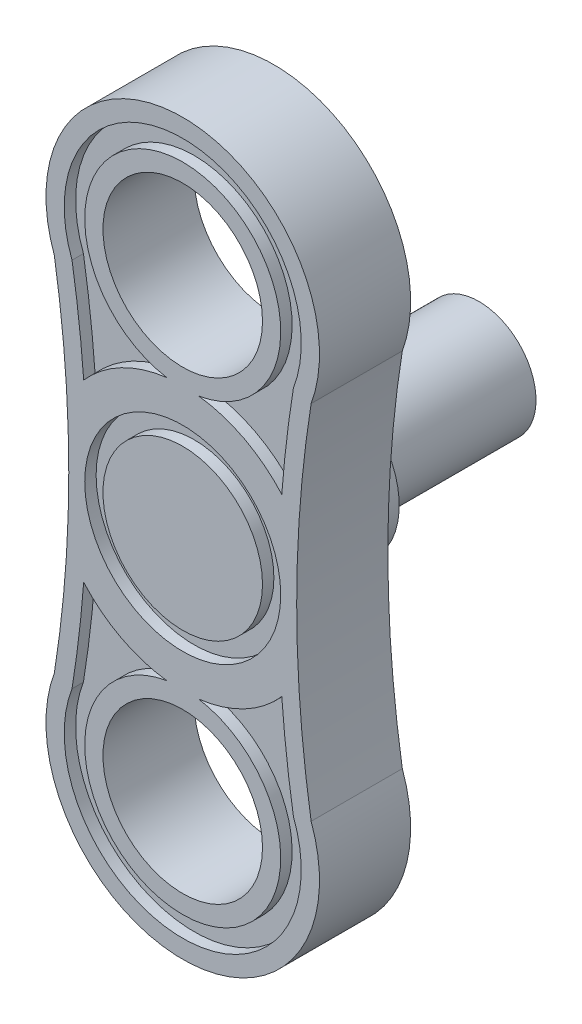
ISO-10303-21;
HEADER;
FILE_DESCRIPTION(('STEP AP214'),'2;1');
FILE_NAME('part.step','',(''),(''),'','','');
FILE_SCHEMA(('AUTOMOTIVE_DESIGN { 1 0 10303 214 1 1 1 1 }'));
ENDSEC;
DATA;
#1=APPLICATION_CONTEXT('core data for automotive mechanical design processes');
#2=APPLICATION_PROTOCOL_DEFINITION('international standard','automotive_design',2000,#1);
#3=PRODUCT_CONTEXT('',#1,'mechanical');
#4=PRODUCT('Part','Part','',(#3));
#5=PRODUCT_RELATED_PRODUCT_CATEGORY('part','',(#4));
#6=PRODUCT_DEFINITION_FORMATION('','',#4);
#7=PRODUCT_DEFINITION_CONTEXT('part definition',#1,'design');
#8=PRODUCT_DEFINITION('design','',#6,#7);
#9=PRODUCT_DEFINITION_SHAPE('','',#8);
#10=(LENGTH_UNIT() NAMED_UNIT(*) SI_UNIT(.MILLI.,.METRE.));
#11=(NAMED_UNIT(*) PLANE_ANGLE_UNIT() SI_UNIT($,.RADIAN.));
#12=(NAMED_UNIT(*) SI_UNIT($,.STERADIAN.) SOLID_ANGLE_UNIT());
#13=UNCERTAINTY_MEASURE_WITH_UNIT(LENGTH_MEASURE(1.E-05),#10,'distance_accuracy_value','');
#14=(GEOMETRIC_REPRESENTATION_CONTEXT(3) GLOBAL_UNCERTAINTY_ASSIGNED_CONTEXT((#13)) GLOBAL_UNIT_ASSIGNED_CONTEXT((#10,
#11,#12)) REPRESENTATION_CONTEXT('',''));
#15=CARTESIAN_POINT('',(0.,0.,0.));
#16=DIRECTION('',(0.,0.,1.));
#17=DIRECTION('',(1.,0.,0.));
#18=AXIS2_PLACEMENT_3D('',#15,#16,#17);
#19=CARTESIAN_POINT('',(-275.,-50.,0.));
#20=DIRECTION('',(0.,0.,1.));
#21=DIRECTION('',(1.,0.,0.));
#22=AXIS2_PLACEMENT_3D('',#19,#20,#21);
#23=PLANE('',#22);
#24=CARTESIAN_POINT('',(0.,-200.,0.));
#25=DIRECTION('',(0.,0.,1.));
#26=DIRECTION('',(1.,0.,0.));
#27=AXIS2_PLACEMENT_3D('',#24,#25,#26);
#28=CIRCLE('',#27,35.);
#29=CARTESIAN_POINT('',(35.,-200.,0.));
#30=VERTEX_POINT('',#29);
#31=EDGE_CURVE('E602',#30,#30,#28,.F.);
#32=ORIENTED_EDGE('',*,*,#31,.T.);
#33=EDGE_LOOP('',(#32));
#34=FACE_BOUND('',#33,.T.);
#35=CARTESIAN_POINT('',(-550.,-100.,0.));
#36=DIRECTION('',(0.,0.,-1.));
#37=DIRECTION('',(1.,0.,0.));
#38=AXIS2_PLACEMENT_3D('',#35,#36,#37);
#39=CIRCLE('',#38,500.);
#40=CARTESIAN_POINT('',(-56.3381847087752,-20.6399841017363,0.));
#41=VERTEX_POINT('',#40);
#42=CARTESIAN_POINT('',(-56.3381847087752,-179.360015898264,0.));
#43=VERTEX_POINT('',#42);
#44=EDGE_CURVE('E304',#41,#43,#39,.T.);
#45=ORIENTED_EDGE('',*,*,#44,.T.);
#46=CARTESIAN_POINT('',(0.,-200.,0.));
#47=DIRECTION('',(0.,0.,1.));
#48=DIRECTION('',(1.,0.,0.));
#49=AXIS2_PLACEMENT_3D('',#46,#47,#48);
#50=CIRCLE('',#49,60.);
#51=CARTESIAN_POINT('',(56.3381847087753,-179.360015898264,0.));
#52=VERTEX_POINT('',#51);
#53=EDGE_CURVE('E321',#43,#52,#50,.T.);
#54=ORIENTED_EDGE('',*,*,#53,.T.);
#55=CARTESIAN_POINT('',(550.,-100.,0.));
#56=DIRECTION('',(0.,0.,-1.));
#57=DIRECTION('',(-1.,0.,0.));
#58=AXIS2_PLACEMENT_3D('',#55,#56,#57);
#59=CIRCLE('',#58,500.);
#60=CARTESIAN_POINT('',(56.3381847087752,-20.6399841017363,0.));
#61=VERTEX_POINT('',#60);
#62=EDGE_CURVE('E324',#52,#61,#59,.T.);
#63=ORIENTED_EDGE('',*,*,#62,.T.);
#64=CARTESIAN_POINT('',(0.,0.,0.));
#65=DIRECTION('',(0.,0.,1.));
#66=DIRECTION('',(1.,0.,0.));
#67=AXIS2_PLACEMENT_3D('',#64,#65,#66);
#68=CIRCLE('',#67,60.);
#69=EDGE_CURVE('E309',#61,#41,#68,.T.);
#70=ORIENTED_EDGE('',*,*,#69,.T.);
#71=EDGE_LOOP('',(#45,#54,#63,#70));
#72=FACE_BOUND('',#71,.T.);
#73=CARTESIAN_POINT('',(0.,-200.,0.));
#74=DIRECTION('',(0.,0.,-1.));
#75=DIRECTION('',(-1.,0.,0.));
#76=AXIS2_PLACEMENT_3D('',#73,#74,#75);
#77=CIRCLE('',#76,43.);
#78=CARTESIAN_POINT('',(7.00852159873964,-157.575,0.));
#79=VERTEX_POINT('',#78);
#80=CARTESIAN_POINT('',(-7.00852159873959,-157.575,0.));
#81=VERTEX_POINT('',#80);
#82=EDGE_CURVE('E265',#79,#81,#77,.T.);
#83=ORIENTED_EDGE('',*,*,#82,.F.);
#84=CARTESIAN_POINT('',(0.,-100.,0.));
#85=DIRECTION('',(0.,0.,1.));
#86=DIRECTION('',(1.,0.,0.));
#87=AXIS2_PLACEMENT_3D('',#84,#85,#86);
#88=CIRCLE('',#87,57.9999999999996);
#89=CARTESIAN_POINT('',(43.4545454545454,-138.414873152709,0.));
#90=VERTEX_POINT('',#89);
#91=EDGE_CURVE('E111',#79,#90,#88,.T.);
#92=ORIENTED_EDGE('',*,*,#91,.T.);
#93=CARTESIAN_POINT('',(550.,-100.,0.));
#94=DIRECTION('',(0.,0.,1.));
#95=DIRECTION('',(1.,0.,0.));
#96=AXIS2_PLACEMENT_3D('',#93,#94,#95);
#97=CIRCLE('',#96,508.);
#98=CARTESIAN_POINT('',(48.5672389748015,-181.419814361408,0.));
#99=VERTEX_POINT('',#98);
#100=EDGE_CURVE('E279',#90,#99,#97,.T.);
#101=ORIENTED_EDGE('',*,*,#100,.T.);
#102=CARTESIAN_POINT('',(0.,-200.,0.));
#103=DIRECTION('',(0.,0.,1.));
#104=DIRECTION('',(1.,0.,0.));
#105=AXIS2_PLACEMENT_3D('',#102,#103,#104);
#106=CIRCLE('',#105,52.);
#107=CARTESIAN_POINT('',(-48.5672389748017,-181.419814361409,0.));
#108=VERTEX_POINT('',#107);
#109=EDGE_CURVE('E282',#108,#99,#106,.T.);
#110=ORIENTED_EDGE('',*,*,#109,.F.);
#111=CARTESIAN_POINT('',(-550.,-100.,0.));
#112=DIRECTION('',(0.,0.,1.));
#113=DIRECTION('',(1.,0.,0.));
#114=AXIS2_PLACEMENT_3D('',#111,#112,#113);
#115=CIRCLE('',#114,508.);
#116=CARTESIAN_POINT('',(-43.4545454545454,-138.41487315271,0.));
#117=VERTEX_POINT('',#116);
#118=EDGE_CURVE('E285',#108,#117,#115,.T.);
#119=ORIENTED_EDGE('',*,*,#118,.T.);
#120=CARTESIAN_POINT('',(0.,-100.,0.));
#121=DIRECTION('',(0.,0.,1.));
#122=DIRECTION('',(1.,0.,0.));
#123=AXIS2_PLACEMENT_3D('',#120,#121,#122);
#124=CIRCLE('',#123,57.9999999999996);
#125=EDGE_CURVE('E288',#117,#81,#124,.T.);
#126=ORIENTED_EDGE('',*,*,#125,.T.);
#127=EDGE_LOOP('',(#83,#92,#101,#110,#119,#126));
#128=FACE_BOUND('',#127,.T.);
#129=CARTESIAN_POINT('',(0.,-100.,0.));
#130=DIRECTION('',(0.,0.,1.));
#131=DIRECTION('',(1.,0.,0.));
#132=AXIS2_PLACEMENT_3D('',#129,#130,#131);
#133=CIRCLE('',#132,57.9999999999992);
#134=CARTESIAN_POINT('',(43.4545454545454,-61.5851268472906,0.));
#135=VERTEX_POINT('',#134);
#136=CARTESIAN_POINT('',(7.00852159873692,-42.4250000000004,0.));
#137=VERTEX_POINT('',#136);
#138=EDGE_CURVE('E218',#135,#137,#133,.T.);
#139=ORIENTED_EDGE('',*,*,#138,.T.);
#140=CARTESIAN_POINT('',(0.,0.,0.));
#141=DIRECTION('',(0.,0.,1.));
#142=DIRECTION('',(1.,0.,0.));
#143=AXIS2_PLACEMENT_3D('',#140,#141,#142);
#144=CIRCLE('',#143,43.);
#145=CARTESIAN_POINT('',(-7.00852159873692,-42.4250000000004,0.));
#146=VERTEX_POINT('',#145);
#147=EDGE_CURVE('E103',#137,#146,#144,.T.);
#148=ORIENTED_EDGE('',*,*,#147,.T.);
#149=CARTESIAN_POINT('',(0.,-100.,0.));
#150=DIRECTION('',(0.,0.,1.));
#151=DIRECTION('',(1.,0.,0.));
#152=AXIS2_PLACEMENT_3D('',#149,#150,#151);
#153=CIRCLE('',#152,57.9999999999992);
#154=CARTESIAN_POINT('',(-43.4545454545454,-61.5851268472905,0.));
#155=VERTEX_POINT('',#154);
#156=EDGE_CURVE('E233',#146,#155,#153,.T.);
#157=ORIENTED_EDGE('',*,*,#156,.T.);
#158=CARTESIAN_POINT('',(-550.,-100.,0.));
#159=DIRECTION('',(0.,0.,1.));
#160=DIRECTION('',(1.,0.,0.));
#161=AXIS2_PLACEMENT_3D('',#158,#159,#160);
#162=CIRCLE('',#161,508.);
#163=CARTESIAN_POINT('',(-48.5672389748015,-18.5801856385915,0.));
#164=VERTEX_POINT('',#163);
#165=EDGE_CURVE('E228',#155,#164,#162,.T.);
#166=ORIENTED_EDGE('',*,*,#165,.T.);
#167=CARTESIAN_POINT('',(0.,0.,0.));
#168=DIRECTION('',(0.,0.,1.));
#169=DIRECTION('',(1.,0.,0.));
#170=AXIS2_PLACEMENT_3D('',#167,#168,#169);
#171=CIRCLE('',#170,52.);
#172=CARTESIAN_POINT('',(48.5672389748018,-18.5801856385908,0.));
#173=VERTEX_POINT('',#172);
#174=EDGE_CURVE('E226',#173,#164,#171,.T.);
#175=ORIENTED_EDGE('',*,*,#174,.F.);
#176=CARTESIAN_POINT('',(550.,-100.,0.));
#177=DIRECTION('',(0.,0.,1.));
#178=DIRECTION('',(1.,0.,0.));
#179=AXIS2_PLACEMENT_3D('',#176,#177,#178);
#180=CIRCLE('',#179,508.);
#181=EDGE_CURVE('E208',#173,#135,#180,.T.);
#182=ORIENTED_EDGE('',*,*,#181,.T.);
#183=EDGE_LOOP('',(#139,#148,#157,#166,#175,#182));
#184=FACE_BOUND('',#183,.T.);
#185=CARTESIAN_POINT('',(0.,-100.,0.));
#186=DIRECTION('',(0.,0.,1.));
#187=DIRECTION('',(1.,0.,0.));
#188=AXIS2_PLACEMENT_3D('',#185,#186,#187);
#189=CIRCLE('',#188,43.);
#190=CARTESIAN_POINT('',(43.,-100.,0.));
#191=VERTEX_POINT('',#190);
#192=EDGE_CURVE('E250',#191,#191,#189,.T.);
#193=ORIENTED_EDGE('',*,*,#192,.F.);
#194=EDGE_LOOP('',(#193));
#195=FACE_BOUND('',#194,.T.);
#196=CARTESIAN_POINT('',(0.,0.,0.));
#197=DIRECTION('',(0.,0.,1.));
#198=DIRECTION('',(1.,0.,0.));
#199=AXIS2_PLACEMENT_3D('',#196,#197,#198);
#200=CIRCLE('',#199,35.);
#201=CARTESIAN_POINT('',(35.,0.,0.));
#202=VERTEX_POINT('',#201);
#203=EDGE_CURVE('E606',#202,#202,#200,.T.);
#204=ORIENTED_EDGE('',*,*,#203,.F.);
#205=EDGE_LOOP('',(#204));
#206=FACE_BOUND('',#205,.T.);
#207=ADVANCED_FACE('F86',(#34,#72,#128,#184,#195,#206),#23,.T.);
#208=CARTESIAN_POINT('',(-275.,-50.,-40.));
#209=DIRECTION('',(0.,0.,1.));
#210=DIRECTION('',(1.,0.,0.));
#211=AXIS2_PLACEMENT_3D('',#208,#209,#210);
#212=PLANE('',#211);
#213=CARTESIAN_POINT('',(0.,-100.,-40.));
#214=DIRECTION('',(0.,0.,-1.));
#215=DIRECTION('',(-1.,0.,0.));
#216=AXIS2_PLACEMENT_3D('',#213,#214,#215);
#217=CIRCLE('',#216,35.);
#218=CARTESIAN_POINT('',(-35.,-100.,-40.));
#219=VERTEX_POINT('',#218);
#220=EDGE_CURVE('E12',#219,#219,#217,.T.);
#221=ORIENTED_EDGE('',*,*,#220,.F.);
#222=EDGE_LOOP('',(#221));
#223=FACE_BOUND('',#222,.T.);
#224=CARTESIAN_POINT('',(-550.,-100.,-40.));
#225=DIRECTION('',(0.,0.,-1.));
#226=DIRECTION('',(1.,0.,0.));
#227=AXIS2_PLACEMENT_3D('',#224,#225,#226);
#228=CIRCLE('',#227,500.);
#229=CARTESIAN_POINT('',(-56.3381847087752,-20.6399841017363,-40.));
#230=VERTEX_POINT('',#229);
#231=CARTESIAN_POINT('',(-56.3381847087752,-179.360015898264,-40.));
#232=VERTEX_POINT('',#231);
#233=EDGE_CURVE('E305',#230,#232,#228,.T.);
#234=ORIENTED_EDGE('',*,*,#233,.F.);
#235=CARTESIAN_POINT('',(0.,0.,-40.));
#236=DIRECTION('',(0.,0.,1.));
#237=DIRECTION('',(1.,0.,0.));
#238=AXIS2_PLACEMENT_3D('',#235,#236,#237);
#239=CIRCLE('',#238,60.);
#240=CARTESIAN_POINT('',(56.3381847087752,-20.6399841017363,-40.));
#241=VERTEX_POINT('',#240);
#242=EDGE_CURVE('E315',#241,#230,#239,.T.);
#243=ORIENTED_EDGE('',*,*,#242,.F.);
#244=CARTESIAN_POINT('',(550.,-100.,-40.));
#245=DIRECTION('',(0.,0.,-1.));
#246=DIRECTION('',(-1.,0.,0.));
#247=AXIS2_PLACEMENT_3D('',#244,#245,#246);
#248=CIRCLE('',#247,500.);
#249=CARTESIAN_POINT('',(56.3381847087753,-179.360015898264,-40.));
#250=VERTEX_POINT('',#249);
#251=EDGE_CURVE('E312',#250,#241,#248,.T.);
#252=ORIENTED_EDGE('',*,*,#251,.F.);
#253=CARTESIAN_POINT('',(0.,-200.,-40.));
#254=DIRECTION('',(0.,0.,1.));
#255=DIRECTION('',(1.,0.,0.));
#256=AXIS2_PLACEMENT_3D('',#253,#254,#255);
#257=CIRCLE('',#256,60.);
#258=EDGE_CURVE('E308',#232,#250,#257,.T.);
#259=ORIENTED_EDGE('',*,*,#258,.F.);
#260=EDGE_LOOP('',(#234,#243,#252,#259));
#261=FACE_BOUND('',#260,.T.);
#262=CARTESIAN_POINT('',(0.,-200.,-40.));
#263=DIRECTION('',(0.,0.,-1.));
#264=DIRECTION('',(-1.,0.,0.));
#265=AXIS2_PLACEMENT_3D('',#262,#263,#264);
#266=CIRCLE('',#265,35.);
#267=CARTESIAN_POINT('',(-35.,-200.,-40.));
#268=VERTEX_POINT('',#267);
#269=EDGE_CURVE('E597',#268,#268,#266,.T.);
#270=ORIENTED_EDGE('',*,*,#269,.F.);
#271=EDGE_LOOP('',(#270));
#272=FACE_BOUND('',#271,.T.);
#273=CARTESIAN_POINT('',(0.,0.,-40.));
#274=DIRECTION('',(0.,0.,1.));
#275=DIRECTION('',(1.,0.,0.));
#276=AXIS2_PLACEMENT_3D('',#273,#274,#275);
#277=CIRCLE('',#276,35.);
#278=CARTESIAN_POINT('',(35.,0.,-40.));
#279=VERTEX_POINT('',#278);
#280=EDGE_CURVE('E599',#279,#279,#277,.T.);
#281=ORIENTED_EDGE('',*,*,#280,.T.);
#282=EDGE_LOOP('',(#281));
#283=FACE_BOUND('',#282,.T.);
#284=ADVANCED_FACE('F348',(#223,#261,#272,#283),#212,.F.);
#285=CARTESIAN_POINT('',(-550.,-100.,-40.));
#286=DIRECTION('',(0.,0.,1.));
#287=DIRECTION('',(1.,0.,0.));
#288=AXIS2_PLACEMENT_3D('',#285,#286,#287);
#289=CYLINDRICAL_SURFACE('',#288,500.);
#290=ORIENTED_EDGE('',*,*,#44,.F.);
#291=DIRECTION('',(0.,0.,1.));
#292=VECTOR('',#291,1.);
#293=CARTESIAN_POINT('',(-56.3381847087752,-20.6399841017363,-40.));
#294=LINE('',#293,#292);
#295=EDGE_CURVE('E95',#230,#41,#294,.T.);
#296=ORIENTED_EDGE('',*,*,#295,.F.);
#297=ORIENTED_EDGE('',*,*,#233,.T.);
#298=DIRECTION('',(0.,0.,1.));
#299=VECTOR('',#298,1.);
#300=CARTESIAN_POINT('',(-56.3381847087752,-179.360015898264,-40.));
#301=LINE('',#300,#299);
#302=EDGE_CURVE('E318',#232,#43,#301,.T.);
#303=ORIENTED_EDGE('',*,*,#302,.T.);
#304=EDGE_LOOP('',(#290,#296,#297,#303));
#305=FACE_BOUND('',#304,.T.);
#306=ADVANCED_FACE('F88',(#305),#289,.F.);
#307=CARTESIAN_POINT('',(0.,0.,-40.));
#308=DIRECTION('',(0.,0.,1.));
#309=DIRECTION('',(1.,0.,0.));
#310=AXIS2_PLACEMENT_3D('',#307,#308,#309);
#311=CYLINDRICAL_SURFACE('',#310,60.);
#312=ORIENTED_EDGE('',*,*,#69,.F.);
#313=DIRECTION('',(0.,0.,1.));
#314=VECTOR('',#313,1.);
#315=CARTESIAN_POINT('',(56.3381847087752,-20.6399841017363,-40.));
#316=LINE('',#315,#314);
#317=EDGE_CURVE('E330',#241,#61,#316,.T.);
#318=ORIENTED_EDGE('',*,*,#317,.F.);
#319=ORIENTED_EDGE('',*,*,#242,.T.);
#320=ORIENTED_EDGE('',*,*,#295,.T.);
#321=EDGE_LOOP('',(#312,#318,#319,#320));
#322=FACE_BOUND('',#321,.T.);
#323=ADVANCED_FACE('F345',(#322),#311,.T.);
#324=CARTESIAN_POINT('',(550.,-100.,-40.));
#325=DIRECTION('',(0.,0.,1.));
#326=DIRECTION('',(1.,0.,0.));
#327=AXIS2_PLACEMENT_3D('',#324,#325,#326);
#328=CYLINDRICAL_SURFACE('',#327,500.);
#329=ORIENTED_EDGE('',*,*,#62,.F.);
#330=DIRECTION('',(0.,0.,1.));
#331=VECTOR('',#330,1.);
#332=CARTESIAN_POINT('',(56.3381847087753,-179.360015898264,-40.));
#333=LINE('',#332,#331);
#334=EDGE_CURVE('E332',#250,#52,#333,.T.);
#335=ORIENTED_EDGE('',*,*,#334,.F.);
#336=ORIENTED_EDGE('',*,*,#251,.T.);
#337=ORIENTED_EDGE('',*,*,#317,.T.);
#338=EDGE_LOOP('',(#329,#335,#336,#337));
#339=FACE_BOUND('',#338,.T.);
#340=ADVANCED_FACE('F352',(#339),#328,.F.);
#341=CARTESIAN_POINT('',(0.,-200.,-40.));
#342=DIRECTION('',(0.,0.,1.));
#343=DIRECTION('',(1.,0.,0.));
#344=AXIS2_PLACEMENT_3D('',#341,#342,#343);
#345=CYLINDRICAL_SURFACE('',#344,60.);
#346=ORIENTED_EDGE('',*,*,#53,.F.);
#347=ORIENTED_EDGE('',*,*,#302,.F.);
#348=ORIENTED_EDGE('',*,*,#258,.T.);
#349=ORIENTED_EDGE('',*,*,#334,.T.);
#350=EDGE_LOOP('',(#346,#347,#348,#349));
#351=FACE_BOUND('',#350,.T.);
#352=ADVANCED_FACE('F339',(#351),#345,.T.);
#353=CARTESIAN_POINT('',(0.,-100.,-5.));
#354=DIRECTION('',(0.,0.,1.));
#355=DIRECTION('',(1.,0.,0.));
#356=AXIS2_PLACEMENT_3D('',#353,#354,#355);
#357=CYLINDRICAL_SURFACE('',#356,57.9999999999996);
#358=ORIENTED_EDGE('',*,*,#91,.F.);
#359=DIRECTION('',(0.,0.,1.));
#360=VECTOR('',#359,1.);
#361=CARTESIAN_POINT('',(7.00852159873964,-157.575,-5.));
#362=LINE('',#361,#360);
#363=CARTESIAN_POINT('',(7.00852159873964,-157.575,-5.));
#364=VERTEX_POINT('',#363);
#365=EDGE_CURVE('E277',#364,#79,#362,.T.);
#366=ORIENTED_EDGE('',*,*,#365,.F.);
#367=CARTESIAN_POINT('',(0.,-100.,-5.));
#368=DIRECTION('',(0.,0.,1.));
#369=DIRECTION('',(1.,0.,0.));
#370=AXIS2_PLACEMENT_3D('',#367,#368,#369);
#371=CIRCLE('',#370,57.9999999999996);
#372=CARTESIAN_POINT('',(43.4545454545454,-138.414873152709,-5.));
#373=VERTEX_POINT('',#372);
#374=EDGE_CURVE('E261',#364,#373,#371,.T.);
#375=ORIENTED_EDGE('',*,*,#374,.T.);
#376=DIRECTION('',(0.,0.,1.));
#377=VECTOR('',#376,1.);
#378=CARTESIAN_POINT('',(43.4545454545454,-138.414873152709,-5.));
#379=LINE('',#378,#377);
#380=EDGE_CURVE('E302',#373,#90,#379,.T.);
#381=ORIENTED_EDGE('',*,*,#380,.T.);
#382=EDGE_LOOP('',(#358,#366,#375,#381));
#383=FACE_BOUND('',#382,.T.);
#384=ADVANCED_FACE('F359',(#383),#357,.T.);
#385=CARTESIAN_POINT('',(550.,-100.,-5.));
#386=DIRECTION('',(0.,0.,1.));
#387=DIRECTION('',(1.,0.,0.));
#388=AXIS2_PLACEMENT_3D('',#385,#386,#387);
#389=CYLINDRICAL_SURFACE('',#388,508.);
#390=ORIENTED_EDGE('',*,*,#100,.F.);
#391=ORIENTED_EDGE('',*,*,#380,.F.);
#392=CARTESIAN_POINT('',(550.,-100.,-5.));
#393=DIRECTION('',(0.,0.,1.));
#394=DIRECTION('',(1.,0.,0.));
#395=AXIS2_PLACEMENT_3D('',#392,#393,#394);
#396=CIRCLE('',#395,508.);
#397=CARTESIAN_POINT('',(48.5672389748015,-181.419814361408,-5.));
#398=VERTEX_POINT('',#397);
#399=EDGE_CURVE('E264',#373,#398,#396,.T.);
#400=ORIENTED_EDGE('',*,*,#399,.T.);
#401=DIRECTION('',(0.,0.,1.));
#402=VECTOR('',#401,1.);
#403=CARTESIAN_POINT('',(48.5672389748015,-181.419814361408,-5.));
#404=LINE('',#403,#402);
#405=EDGE_CURVE('E300',#398,#99,#404,.T.);
#406=ORIENTED_EDGE('',*,*,#405,.T.);
#407=EDGE_LOOP('',(#390,#391,#400,#406));
#408=FACE_BOUND('',#407,.T.);
#409=ADVANCED_FACE('F415',(#408),#389,.T.);
#410=CARTESIAN_POINT('',(0.,-200.,-5.));
#411=DIRECTION('',(0.,0.,1.));
#412=DIRECTION('',(1.,0.,0.));
#413=AXIS2_PLACEMENT_3D('',#410,#411,#412);
#414=CYLINDRICAL_SURFACE('',#413,52.);
#415=ORIENTED_EDGE('',*,*,#109,.T.);
#416=ORIENTED_EDGE('',*,*,#405,.F.);
#417=CARTESIAN_POINT('',(0.,-200.,-5.));
#418=DIRECTION('',(0.,0.,1.));
#419=DIRECTION('',(1.,0.,0.));
#420=AXIS2_PLACEMENT_3D('',#417,#418,#419);
#421=CIRCLE('',#420,52.);
#422=CARTESIAN_POINT('',(-48.5672389748017,-181.419814361409,-5.));
#423=VERTEX_POINT('',#422);
#424=EDGE_CURVE('E267',#423,#398,#421,.T.);
#425=ORIENTED_EDGE('',*,*,#424,.F.);
#426=DIRECTION('',(0.,0.,1.));
#427=VECTOR('',#426,1.);
#428=CARTESIAN_POINT('',(-48.5672389748017,-181.419814361409,-5.));
#429=LINE('',#428,#427);
#430=EDGE_CURVE('E298',#423,#108,#429,.T.);
#431=ORIENTED_EDGE('',*,*,#430,.T.);
#432=EDGE_LOOP('',(#415,#416,#425,#431));
#433=FACE_BOUND('',#432,.T.);
#434=ADVANCED_FACE('F411',(#433),#414,.F.);
#435=CARTESIAN_POINT('',(-550.,-100.,-5.));
#436=DIRECTION('',(0.,0.,1.));
#437=DIRECTION('',(1.,0.,0.));
#438=AXIS2_PLACEMENT_3D('',#435,#436,#437);
#439=CYLINDRICAL_SURFACE('',#438,508.);
#440=ORIENTED_EDGE('',*,*,#118,.F.);
#441=ORIENTED_EDGE('',*,*,#430,.F.);
#442=CARTESIAN_POINT('',(-550.,-100.,-5.));
#443=DIRECTION('',(0.,0.,1.));
#444=DIRECTION('',(1.,0.,0.));
#445=AXIS2_PLACEMENT_3D('',#442,#443,#444);
#446=CIRCLE('',#445,508.);
#447=CARTESIAN_POINT('',(-43.4545454545454,-138.41487315271,-5.));
#448=VERTEX_POINT('',#447);
#449=EDGE_CURVE('E270',#423,#448,#446,.T.);
#450=ORIENTED_EDGE('',*,*,#449,.T.);
#451=DIRECTION('',(0.,0.,1.));
#452=VECTOR('',#451,1.);
#453=CARTESIAN_POINT('',(-43.4545454545454,-138.41487315271,-5.));
#454=LINE('',#453,#452);
#455=EDGE_CURVE('E296',#448,#117,#454,.T.);
#456=ORIENTED_EDGE('',*,*,#455,.T.);
#457=EDGE_LOOP('',(#440,#441,#450,#456));
#458=FACE_BOUND('',#457,.T.);
#459=ADVANCED_FACE('F407',(#458),#439,.T.);
#460=CARTESIAN_POINT('',(0.,-100.,-5.));
#461=DIRECTION('',(0.,0.,1.));
#462=DIRECTION('',(1.,0.,0.));
#463=AXIS2_PLACEMENT_3D('',#460,#461,#462);
#464=CYLINDRICAL_SURFACE('',#463,57.9999999999996);
#465=ORIENTED_EDGE('',*,*,#125,.F.);
#466=ORIENTED_EDGE('',*,*,#455,.F.);
#467=CARTESIAN_POINT('',(0.,-100.,-5.));
#468=DIRECTION('',(0.,0.,1.));
#469=DIRECTION('',(1.,0.,0.));
#470=AXIS2_PLACEMENT_3D('',#467,#468,#469);
#471=CIRCLE('',#470,57.9999999999996);
#472=CARTESIAN_POINT('',(-7.00852159873959,-157.575,-5.));
#473=VERTEX_POINT('',#472);
#474=EDGE_CURVE('E272',#448,#473,#471,.T.);
#475=ORIENTED_EDGE('',*,*,#474,.T.);
#476=DIRECTION('',(0.,0.,1.));
#477=VECTOR('',#476,1.);
#478=CARTESIAN_POINT('',(-7.00852159873959,-157.575,-5.));
#479=LINE('',#478,#477);
#480=EDGE_CURVE('E294',#473,#81,#479,.T.);
#481=ORIENTED_EDGE('',*,*,#480,.T.);
#482=EDGE_LOOP('',(#465,#466,#475,#481));
#483=FACE_BOUND('',#482,.T.);
#484=ADVANCED_FACE('F403',(#483),#464,.T.);
#485=CARTESIAN_POINT('',(0.,-200.,-5.));
#486=DIRECTION('',(0.,0.,1.));
#487=DIRECTION('',(1.,0.,0.));
#488=AXIS2_PLACEMENT_3D('',#485,#486,#487);
#489=CYLINDRICAL_SURFACE('',#488,43.);
#490=ORIENTED_EDGE('',*,*,#82,.T.);
#491=ORIENTED_EDGE('',*,*,#480,.F.);
#492=CARTESIAN_POINT('',(0.,-200.,-5.));
#493=DIRECTION('',(0.,0.,-1.));
#494=DIRECTION('',(-1.,0.,0.));
#495=AXIS2_PLACEMENT_3D('',#492,#493,#494);
#496=CIRCLE('',#495,43.);
#497=EDGE_CURVE('E274',#364,#473,#496,.T.);
#498=ORIENTED_EDGE('',*,*,#497,.F.);
#499=ORIENTED_EDGE('',*,*,#365,.T.);
#500=EDGE_LOOP('',(#490,#491,#498,#499));
#501=FACE_BOUND('',#500,.T.);
#502=ADVANCED_FACE('F399',(#501),#489,.T.);
#503=CARTESIAN_POINT('',(275.,-100.,-5.));
#504=DIRECTION('',(0.,0.,1.));
#505=DIRECTION('',(1.,0.,0.));
#506=AXIS2_PLACEMENT_3D('',#503,#504,#505);
#507=PLANE('',#506);
#508=ORIENTED_EDGE('',*,*,#374,.F.);
#509=ORIENTED_EDGE('',*,*,#497,.T.);
#510=ORIENTED_EDGE('',*,*,#474,.F.);
#511=ORIENTED_EDGE('',*,*,#449,.F.);
#512=ORIENTED_EDGE('',*,*,#424,.T.);
#513=ORIENTED_EDGE('',*,*,#399,.F.);
#514=EDGE_LOOP('',(#508,#509,#510,#511,#512,#513));
#515=FACE_BOUND('',#514,.T.);
#516=ADVANCED_FACE('F395',(#515),#507,.T.);
#517=CARTESIAN_POINT('',(0.,0.,-5.));
#518=DIRECTION('',(0.,0.,1.));
#519=DIRECTION('',(1.,0.,0.));
#520=AXIS2_PLACEMENT_3D('',#517,#518,#519);
#521=CYLINDRICAL_SURFACE('',#520,43.);
#522=ORIENTED_EDGE('',*,*,#147,.F.);
#523=DIRECTION('',(0.,0.,1.));
#524=VECTOR('',#523,1.);
#525=CARTESIAN_POINT('',(7.00852159873692,-42.4250000000004,-5.));
#526=LINE('',#525,#524);
#527=CARTESIAN_POINT('',(7.00852159873692,-42.4250000000004,-5.));
#528=VERTEX_POINT('',#527);
#529=EDGE_CURVE('E214',#528,#137,#526,.T.);
#530=ORIENTED_EDGE('',*,*,#529,.F.);
#531=CARTESIAN_POINT('',(0.,0.,-5.));
#532=DIRECTION('',(0.,0.,1.));
#533=DIRECTION('',(1.,0.,0.));
#534=AXIS2_PLACEMENT_3D('',#531,#532,#533);
#535=CIRCLE('',#534,43.);
#536=CARTESIAN_POINT('',(-7.00852159873692,-42.4250000000004,-5.));
#537=VERTEX_POINT('',#536);
#538=EDGE_CURVE('E221',#528,#537,#535,.T.);
#539=ORIENTED_EDGE('',*,*,#538,.T.);
#540=DIRECTION('',(0.,0.,1.));
#541=VECTOR('',#540,1.);
#542=CARTESIAN_POINT('',(-7.00852159873692,-42.4250000000004,-5.));
#543=LINE('',#542,#541);
#544=EDGE_CURVE('E609',#537,#146,#543,.T.);
#545=ORIENTED_EDGE('',*,*,#544,.T.);
#546=EDGE_LOOP('',(#522,#530,#539,#545));
#547=FACE_BOUND('',#546,.T.);
#548=ADVANCED_FACE('F398',(#547),#521,.T.);
#549=CARTESIAN_POINT('',(0.,-100.,-5.));
#550=DIRECTION('',(0.,0.,1.));
#551=DIRECTION('',(1.,0.,0.));
#552=AXIS2_PLACEMENT_3D('',#549,#550,#551);
#553=CYLINDRICAL_SURFACE('',#552,57.9999999999992);
#554=ORIENTED_EDGE('',*,*,#156,.F.);
#555=ORIENTED_EDGE('',*,*,#544,.F.);
#556=CARTESIAN_POINT('',(0.,-100.,-5.));
#557=DIRECTION('',(0.,0.,1.));
#558=DIRECTION('',(1.,0.,0.));
#559=AXIS2_PLACEMENT_3D('',#556,#557,#558);
#560=CIRCLE('',#559,57.9999999999992);
#561=CARTESIAN_POINT('',(-43.4545454545454,-61.5851268472905,-5.));
#562=VERTEX_POINT('',#561);
#563=EDGE_CURVE('E246',#537,#562,#560,.T.);
#564=ORIENTED_EDGE('',*,*,#563,.T.);
#565=DIRECTION('',(0.,0.,1.));
#566=VECTOR('',#565,1.);
#567=CARTESIAN_POINT('',(-43.4545454545454,-61.5851268472905,-5.));
#568=LINE('',#567,#566);
#569=EDGE_CURVE('E611',#562,#155,#568,.T.);
#570=ORIENTED_EDGE('',*,*,#569,.T.);
#571=EDGE_LOOP('',(#554,#555,#564,#570));
#572=FACE_BOUND('',#571,.T.);
#573=ADVANCED_FACE('F455',(#572),#553,.T.);
#574=CARTESIAN_POINT('',(-550.,-100.,-5.));
#575=DIRECTION('',(0.,0.,1.));
#576=DIRECTION('',(1.,0.,0.));
#577=AXIS2_PLACEMENT_3D('',#574,#575,#576);
#578=CYLINDRICAL_SURFACE('',#577,508.);
#579=ORIENTED_EDGE('',*,*,#165,.F.);
#580=ORIENTED_EDGE('',*,*,#569,.F.);
#581=CARTESIAN_POINT('',(-550.,-100.,-5.));
#582=DIRECTION('',(0.,0.,1.));
#583=DIRECTION('',(1.,0.,0.));
#584=AXIS2_PLACEMENT_3D('',#581,#582,#583);
#585=CIRCLE('',#584,508.);
#586=CARTESIAN_POINT('',(-48.5672389748015,-18.5801856385915,-5.));
#587=VERTEX_POINT('',#586);
#588=EDGE_CURVE('E244',#562,#587,#585,.T.);
#589=ORIENTED_EDGE('',*,*,#588,.T.);
#590=DIRECTION('',(0.,0.,1.));
#591=VECTOR('',#590,1.);
#592=CARTESIAN_POINT('',(-48.5672389748015,-18.5801856385915,-5.));
#593=LINE('',#592,#591);
#594=EDGE_CURVE('E613',#587,#164,#593,.T.);
#595=ORIENTED_EDGE('',*,*,#594,.T.);
#596=EDGE_LOOP('',(#579,#580,#589,#595));
#597=FACE_BOUND('',#596,.T.);
#598=ADVANCED_FACE('F462',(#597),#578,.T.);
#599=CARTESIAN_POINT('',(0.,0.,-5.));
#600=DIRECTION('',(0.,0.,1.));
#601=DIRECTION('',(1.,0.,0.));
#602=AXIS2_PLACEMENT_3D('',#599,#600,#601);
#603=CYLINDRICAL_SURFACE('',#602,52.);
#604=ORIENTED_EDGE('',*,*,#174,.T.);
#605=ORIENTED_EDGE('',*,*,#594,.F.);
#606=CARTESIAN_POINT('',(0.,0.,-5.));
#607=DIRECTION('',(0.,0.,1.));
#608=DIRECTION('',(1.,0.,0.));
#609=AXIS2_PLACEMENT_3D('',#606,#607,#608);
#610=CIRCLE('',#609,52.);
#611=CARTESIAN_POINT('',(48.5672389748018,-18.5801856385908,-5.));
#612=VERTEX_POINT('',#611);
#613=EDGE_CURVE('E241',#612,#587,#610,.T.);
#614=ORIENTED_EDGE('',*,*,#613,.F.);
#615=DIRECTION('',(0.,0.,1.));
#616=VECTOR('',#615,1.);
#617=CARTESIAN_POINT('',(48.5672389748018,-18.5801856385908,-5.));
#618=LINE('',#617,#616);
#619=EDGE_CURVE('E215',#612,#173,#618,.T.);
#620=ORIENTED_EDGE('',*,*,#619,.T.);
#621=EDGE_LOOP('',(#604,#605,#614,#620));
#622=FACE_BOUND('',#621,.T.);
#623=ADVANCED_FACE('F470',(#622),#603,.F.);
#624=CARTESIAN_POINT('',(550.,-100.,-5.));
#625=DIRECTION('',(0.,0.,1.));
#626=DIRECTION('',(1.,0.,0.));
#627=AXIS2_PLACEMENT_3D('',#624,#625,#626);
#628=CYLINDRICAL_SURFACE('',#627,508.);
#629=ORIENTED_EDGE('',*,*,#181,.F.);
#630=ORIENTED_EDGE('',*,*,#619,.F.);
#631=CARTESIAN_POINT('',(550.,-100.,-5.));
#632=DIRECTION('',(0.,0.,1.));
#633=DIRECTION('',(1.,0.,0.));
#634=AXIS2_PLACEMENT_3D('',#631,#632,#633);
#635=CIRCLE('',#634,508.);
#636=CARTESIAN_POINT('',(43.4545454545454,-61.5851268472906,-5.));
#637=VERTEX_POINT('',#636);
#638=EDGE_CURVE('E211',#612,#637,#635,.T.);
#639=ORIENTED_EDGE('',*,*,#638,.T.);
#640=DIRECTION('',(0.,0.,1.));
#641=VECTOR('',#640,1.);
#642=CARTESIAN_POINT('',(43.4545454545454,-61.5851268472906,-5.));
#643=LINE('',#642,#641);
#644=EDGE_CURVE('E204',#637,#135,#643,.T.);
#645=ORIENTED_EDGE('',*,*,#644,.T.);
#646=EDGE_LOOP('',(#629,#630,#639,#645));
#647=FACE_BOUND('',#646,.T.);
#648=ADVANCED_FACE('F206',(#647),#628,.T.);
#649=CARTESIAN_POINT('',(0.,-100.,-5.));
#650=DIRECTION('',(0.,0.,1.));
#651=DIRECTION('',(1.,0.,0.));
#652=AXIS2_PLACEMENT_3D('',#649,#650,#651);
#653=CYLINDRICAL_SURFACE('',#652,57.9999999999992);
#654=ORIENTED_EDGE('',*,*,#138,.F.);
#655=ORIENTED_EDGE('',*,*,#644,.F.);
#656=CARTESIAN_POINT('',(0.,-100.,-5.));
#657=DIRECTION('',(0.,0.,1.));
#658=DIRECTION('',(1.,0.,0.));
#659=AXIS2_PLACEMENT_3D('',#656,#657,#658);
#660=CIRCLE('',#659,57.9999999999992);
#661=EDGE_CURVE('E238',#637,#528,#660,.T.);
#662=ORIENTED_EDGE('',*,*,#661,.T.);
#663=ORIENTED_EDGE('',*,*,#529,.T.);
#664=EDGE_LOOP('',(#654,#655,#662,#663));
#665=FACE_BOUND('',#664,.T.);
#666=ADVANCED_FACE('F219',(#665),#653,.T.);
#667=CARTESIAN_POINT('',(0.,-50.,-5.));
#668=DIRECTION('',(0.,0.,1.));
#669=DIRECTION('',(1.,0.,0.));
#670=AXIS2_PLACEMENT_3D('',#667,#668,#669);
#671=PLANE('',#670);
#672=ORIENTED_EDGE('',*,*,#538,.F.);
#673=ORIENTED_EDGE('',*,*,#661,.F.);
#674=ORIENTED_EDGE('',*,*,#638,.F.);
#675=ORIENTED_EDGE('',*,*,#613,.T.);
#676=ORIENTED_EDGE('',*,*,#588,.F.);
#677=ORIENTED_EDGE('',*,*,#563,.F.);
#678=EDGE_LOOP('',(#672,#673,#674,#675,#676,#677));
#679=FACE_BOUND('',#678,.T.);
#680=ADVANCED_FACE('F491',(#679),#671,.T.);
#681=CARTESIAN_POINT('',(0.,-100.,-5.));
#682=DIRECTION('',(0.,0.,1.));
#683=DIRECTION('',(1.,0.,0.));
#684=AXIS2_PLACEMENT_3D('',#681,#682,#683);
#685=CYLINDRICAL_SURFACE('',#684,43.);
#686=CARTESIAN_POINT('',(0.,-100.,-5.));
#687=DIRECTION('',(0.,0.,1.));
#688=DIRECTION('',(1.,0.,0.));
#689=AXIS2_PLACEMENT_3D('',#686,#687,#688);
#690=CIRCLE('',#689,43.);
#691=CARTESIAN_POINT('',(43.,-100.,-5.));
#692=VERTEX_POINT('',#691);
#693=EDGE_CURVE('E237',#692,#692,#690,.T.);
#694=ORIENTED_EDGE('',*,*,#693,.F.);
#695=EDGE_LOOP('',(#694));
#696=FACE_BOUND('',#695,.T.);
#697=ORIENTED_EDGE('',*,*,#192,.T.);
#698=EDGE_LOOP('',(#697));
#699=FACE_BOUND('',#698,.T.);
#700=ADVANCED_FACE('F390',(#696,#699),#685,.F.);
#701=CARTESIAN_POINT('',(0.,-100.,-5.));
#702=DIRECTION('',(0.,0.,1.));
#703=DIRECTION('',(1.,0.,0.));
#704=AXIS2_PLACEMENT_3D('',#701,#702,#703);
#705=PLANE('',#704);
#706=CARTESIAN_POINT('',(0.,-100.,-5.));
#707=DIRECTION('',(0.,0.,1.));
#708=DIRECTION('',(1.,0.,0.));
#709=AXIS2_PLACEMENT_3D('',#706,#707,#708);
#710=CIRCLE('',#709,35.);
#711=CARTESIAN_POINT('',(35.,-100.,-5.));
#712=VERTEX_POINT('',#711);
#713=EDGE_CURVE('E253',#712,#712,#710,.T.);
#714=ORIENTED_EDGE('',*,*,#713,.F.);
#715=EDGE_LOOP('',(#714));
#716=FACE_BOUND('',#715,.T.);
#717=ORIENTED_EDGE('',*,*,#693,.T.);
#718=EDGE_LOOP('',(#717));
#719=FACE_BOUND('',#718,.T.);
#720=ADVANCED_FACE('F382',(#716,#719),#705,.T.);
#721=CARTESIAN_POINT('',(0.,-100.,-5.));
#722=DIRECTION('',(0.,0.,1.));
#723=DIRECTION('',(1.,0.,0.));
#724=AXIS2_PLACEMENT_3D('',#721,#722,#723);
#725=CYLINDRICAL_SURFACE('',#724,35.);
#726=ORIENTED_EDGE('',*,*,#713,.T.);
#727=EDGE_LOOP('',(#726));
#728=FACE_BOUND('',#727,.T.);
#729=CARTESIAN_POINT('',(0.,-100.,0.));
#730=DIRECTION('',(0.,0.,1.));
#731=DIRECTION('',(1.,0.,0.));
#732=AXIS2_PLACEMENT_3D('',#729,#730,#731);
#733=CIRCLE('',#732,35.);
#734=CARTESIAN_POINT('',(35.,-100.,0.));
#735=VERTEX_POINT('',#734);
#736=EDGE_CURVE('E256',#735,#735,#733,.T.);
#737=ORIENTED_EDGE('',*,*,#736,.F.);
#738=EDGE_LOOP('',(#737));
#739=FACE_BOUND('',#738,.T.);
#740=ADVANCED_FACE('F373',(#728,#739),#725,.T.);
#741=ORIENTED_EDGE('',*,*,#736,.T.);
#742=EDGE_LOOP('',(#741));
#743=FACE_BOUND('',#742,.T.);
#744=ADVANCED_FACE('F364',(#743),#23,.T.);
#745=CARTESIAN_POINT('',(0.,-200.,-40.));
#746=DIRECTION('',(0.,0.,1.));
#747=DIRECTION('',(1.,0.,0.));
#748=AXIS2_PLACEMENT_3D('',#745,#746,#747);
#749=CYLINDRICAL_SURFACE('',#748,35.);
#750=ORIENTED_EDGE('',*,*,#31,.F.);
#751=EDGE_LOOP('',(#750));
#752=FACE_BOUND('',#751,.T.);
#753=ORIENTED_EDGE('',*,*,#269,.T.);
#754=EDGE_LOOP('',(#753));
#755=FACE_BOUND('',#754,.T.);
#756=ADVANCED_FACE('F372',(#752,#755),#749,.F.);
#757=CARTESIAN_POINT('',(0.,0.,-40.));
#758=DIRECTION('',(0.,0.,1.));
#759=DIRECTION('',(1.,0.,0.));
#760=AXIS2_PLACEMENT_3D('',#757,#758,#759);
#761=CYLINDRICAL_SURFACE('',#760,35.);
#762=ORIENTED_EDGE('',*,*,#203,.T.);
#763=EDGE_LOOP('',(#762));
#764=FACE_BOUND('',#763,.T.);
#765=ORIENTED_EDGE('',*,*,#280,.F.);
#766=EDGE_LOOP('',(#765));
#767=FACE_BOUND('',#766,.T.);
#768=ADVANCED_FACE('F379',(#764,#767),#761,.F.);
#769=CARTESIAN_POINT('',(0.,-100.,-60.));
#770=DIRECTION('',(0.,0.,1.));
#771=DIRECTION('',(1.,0.,0.));
#772=AXIS2_PLACEMENT_3D('',#769,#770,#771);
#773=CYLINDRICAL_SURFACE('',#772,35.);
#774=CARTESIAN_POINT('',(0.,-100.,-60.));
#775=DIRECTION('',(0.,0.,-1.));
#776=DIRECTION('',(-1.,0.,0.));
#777=AXIS2_PLACEMENT_3D('',#774,#775,#776);
#778=CIRCLE('',#777,35.);
#779=CARTESIAN_POINT('',(-35.,-100.,-60.));
#780=VERTEX_POINT('',#779);
#781=EDGE_CURVE('E594',#780,#780,#778,.T.);
#782=ORIENTED_EDGE('',*,*,#781,.F.);
#783=EDGE_LOOP('',(#782));
#784=FACE_BOUND('',#783,.T.);
#785=ORIENTED_EDGE('',*,*,#220,.T.);
#786=EDGE_LOOP('',(#785));
#787=FACE_BOUND('',#786,.T.);
#788=ADVANCED_FACE('F538',(#784,#787),#773,.T.);
#789=CARTESIAN_POINT('',(0.,-100.,-60.));
#790=DIRECTION('',(0.,0.,-1.));
#791=DIRECTION('',(-1.,0.,0.));
#792=AXIS2_PLACEMENT_3D('',#789,#790,#791);
#793=PLANE('',#792);
#794=CARTESIAN_POINT('',(0.,-100.,-60.));
#795=DIRECTION('',(0.,0.,-1.));
#796=DIRECTION('',(-1.,0.,0.));
#797=AXIS2_PLACEMENT_3D('',#794,#795,#796);
#798=CIRCLE('',#797,25.);
#799=CARTESIAN_POINT('',(-25.,-100.,-60.));
#800=VERTEX_POINT('',#799);
#801=EDGE_CURVE('E90',#800,#800,#798,.F.);
#802=ORIENTED_EDGE('',*,*,#801,.T.);
#803=EDGE_LOOP('',(#802));
#804=FACE_BOUND('',#803,.T.);
#805=ORIENTED_EDGE('',*,*,#781,.T.);
#806=EDGE_LOOP('',(#805));
#807=FACE_BOUND('',#806,.T.);
#808=ADVANCED_FACE('F554',(#804,#807),#793,.T.);
#809=CARTESIAN_POINT('',(0.,-100.,-130.));
#810=DIRECTION('',(0.,0.,1.));
#811=DIRECTION('',(1.,0.,0.));
#812=AXIS2_PLACEMENT_3D('',#809,#810,#811);
#813=CYLINDRICAL_SURFACE('',#812,25.);
#814=ORIENTED_EDGE('',*,*,#801,.F.);
#815=EDGE_LOOP('',(#814));
#816=FACE_BOUND('',#815,.T.);
#817=CARTESIAN_POINT('',(0.,-100.,-130.));
#818=DIRECTION('',(0.,0.,-1.));
#819=DIRECTION('',(-1.,0.,0.));
#820=AXIS2_PLACEMENT_3D('',#817,#818,#819);
#821=CIRCLE('',#820,25.);
#822=CARTESIAN_POINT('',(-25.,-100.,-130.));
#823=VERTEX_POINT('',#822);
#824=EDGE_CURVE('E590',#823,#823,#821,.T.);
#825=ORIENTED_EDGE('',*,*,#824,.F.);
#826=EDGE_LOOP('',(#825));
#827=FACE_BOUND('',#826,.T.);
#828=ADVANCED_FACE('F564',(#816,#827),#813,.T.);
#829=CARTESIAN_POINT('',(0.,-100.,-130.));
#830=DIRECTION('',(0.,0.,-1.));
#831=DIRECTION('',(-1.,0.,0.));
#832=AXIS2_PLACEMENT_3D('',#829,#830,#831);
#833=PLANE('',#832);
#834=ORIENTED_EDGE('',*,*,#824,.T.);
#835=EDGE_LOOP('',(#834));
#836=FACE_BOUND('',#835,.T.);
#837=ADVANCED_FACE('F574',(#836),#833,.T.);
#838=CLOSED_SHELL('',(#207,#284,#306,#323,#340,#352,#384,#409,#434,#459,#484,#502,#516,#548,
#573,#598,#623,#648,#666,#680,#700,#720,#740,#744,#756,#768,#788,#808,#828,#837));
#839=MANIFOLD_SOLID_BREP('B2',#838);
#840=ADVANCED_BREP_SHAPE_REPRESENTATION('',(#18,#839),#14);
#841=SHAPE_DEFINITION_REPRESENTATION(#9,#840);
ENDSEC;
END-ISO-10303-21;
